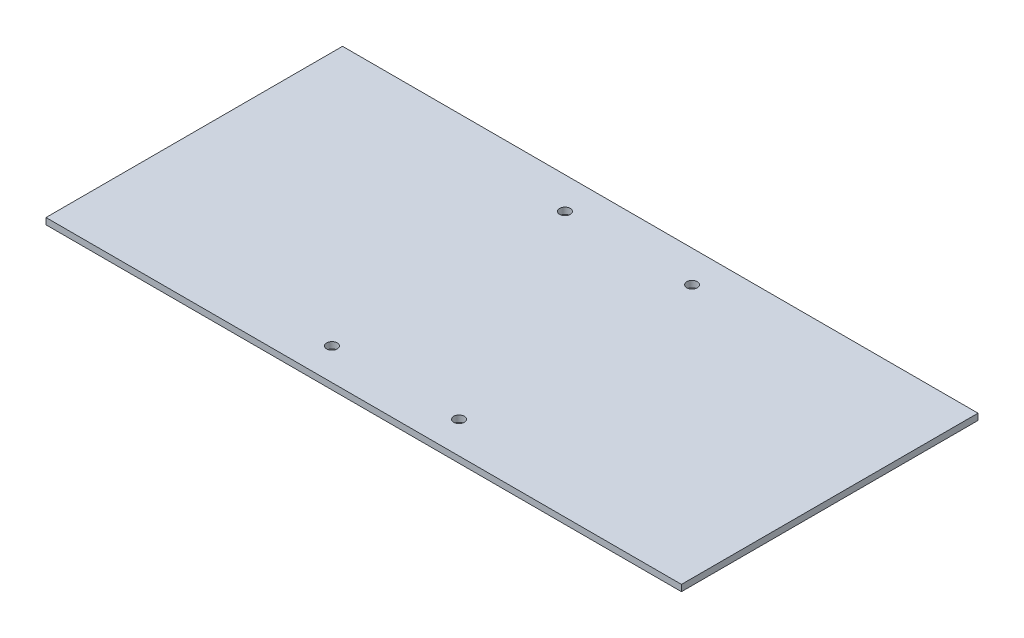
ISO-10303-21;
HEADER;
FILE_DESCRIPTION(('STEP AP214'),'2;1');
FILE_NAME('part.step','',(''),(''),'','','');
FILE_SCHEMA(('AUTOMOTIVE_DESIGN { 1 0 10303 214 1 1 1 1 }'));
ENDSEC;
DATA;
#1=APPLICATION_CONTEXT('core data for automotive mechanical design processes');
#2=APPLICATION_PROTOCOL_DEFINITION('international standard','automotive_design',2000,#1);
#3=PRODUCT_CONTEXT('',#1,'mechanical');
#4=PRODUCT('Part','Part','',(#3));
#5=PRODUCT_RELATED_PRODUCT_CATEGORY('part','',(#4));
#6=PRODUCT_DEFINITION_FORMATION('','',#4);
#7=PRODUCT_DEFINITION_CONTEXT('part definition',#1,'design');
#8=PRODUCT_DEFINITION('design','',#6,#7);
#9=PRODUCT_DEFINITION_SHAPE('','',#8);
#10=(LENGTH_UNIT() NAMED_UNIT(*) SI_UNIT(.MILLI.,.METRE.));
#11=(NAMED_UNIT(*) PLANE_ANGLE_UNIT() SI_UNIT($,.RADIAN.));
#12=(NAMED_UNIT(*) SI_UNIT($,.STERADIAN.) SOLID_ANGLE_UNIT());
#13=UNCERTAINTY_MEASURE_WITH_UNIT(LENGTH_MEASURE(1.E-05),#10,'distance_accuracy_value','');
#14=(GEOMETRIC_REPRESENTATION_CONTEXT(3) GLOBAL_UNCERTAINTY_ASSIGNED_CONTEXT((#13)) GLOBAL_UNIT_ASSIGNED_CONTEXT((#10,
#11,#12)) REPRESENTATION_CONTEXT('',''));
#15=CARTESIAN_POINT('',(0.,0.,0.));
#16=DIRECTION('',(0.,0.,1.));
#17=DIRECTION('',(1.,0.,0.));
#18=AXIS2_PLACEMENT_3D('',#15,#16,#17);
#19=CARTESIAN_POINT('',(-150.,3.,-70.));
#20=DIRECTION('',(1.,0.,0.));
#21=DIRECTION('',(0.,0.,-1.));
#22=AXIS2_PLACEMENT_3D('',#19,#20,#21);
#23=PLANE('',#22);
#24=DIRECTION('',(0.,0.,1.));
#25=VECTOR('',#24,1.);
#26=CARTESIAN_POINT('',(-150.,0.,-70.));
#27=LINE('',#26,#25);
#28=CARTESIAN_POINT('',(-150.,0.,-70.));
#29=VERTEX_POINT('',#28);
#30=CARTESIAN_POINT('',(-150.,0.,70.));
#31=VERTEX_POINT('',#30);
#32=EDGE_CURVE('E98',#29,#31,#27,.T.);
#33=ORIENTED_EDGE('',*,*,#32,.T.);
#34=DIRECTION('',(0.,-1.,0.));
#35=VECTOR('',#34,1.);
#36=CARTESIAN_POINT('',(-150.,3.,70.));
#37=LINE('',#36,#35);
#38=CARTESIAN_POINT('',(-150.,3.,70.));
#39=VERTEX_POINT('',#38);
#40=EDGE_CURVE('E11',#39,#31,#37,.T.);
#41=ORIENTED_EDGE('',*,*,#40,.F.);
#42=DIRECTION('',(0.,0.,1.));
#43=VECTOR('',#42,1.);
#44=CARTESIAN_POINT('',(-150.,3.,-70.));
#45=LINE('',#44,#43);
#46=CARTESIAN_POINT('',(-150.,3.,-70.));
#47=VERTEX_POINT('',#46);
#48=EDGE_CURVE('E86',#47,#39,#45,.T.);
#49=ORIENTED_EDGE('',*,*,#48,.F.);
#50=DIRECTION('',(0.,-1.,0.));
#51=VECTOR('',#50,1.);
#52=CARTESIAN_POINT('',(-150.,3.,-70.));
#53=LINE('',#52,#51);
#54=EDGE_CURVE('E94',#47,#29,#53,.T.);
#55=ORIENTED_EDGE('',*,*,#54,.T.);
#56=EDGE_LOOP('',(#33,#41,#49,#55));
#57=FACE_BOUND('',#56,.T.);
#58=ADVANCED_FACE('F35',(#57),#23,.F.);
#59=CARTESIAN_POINT('',(-150.,3.,70.));
#60=DIRECTION('',(0.,0.,-1.));
#61=DIRECTION('',(-1.,0.,0.));
#62=AXIS2_PLACEMENT_3D('',#59,#60,#61);
#63=PLANE('',#62);
#64=DIRECTION('',(1.,0.,0.));
#65=VECTOR('',#64,1.);
#66=CARTESIAN_POINT('',(-150.,0.,70.));
#67=LINE('',#66,#65);
#68=CARTESIAN_POINT('',(150.,0.,70.));
#69=VERTEX_POINT('',#68);
#70=EDGE_CURVE('E90',#31,#69,#67,.T.);
#71=ORIENTED_EDGE('',*,*,#70,.T.);
#72=DIRECTION('',(0.,-1.,0.));
#73=VECTOR('',#72,1.);
#74=CARTESIAN_POINT('',(150.,3.,70.));
#75=LINE('',#74,#73);
#76=CARTESIAN_POINT('',(150.,3.,70.));
#77=VERTEX_POINT('',#76);
#78=EDGE_CURVE('E43',#77,#69,#75,.T.);
#79=ORIENTED_EDGE('',*,*,#78,.F.);
#80=DIRECTION('',(1.,0.,0.));
#81=VECTOR('',#80,1.);
#82=CARTESIAN_POINT('',(-150.,3.,70.));
#83=LINE('',#82,#81);
#84=EDGE_CURVE('E81',#39,#77,#83,.T.);
#85=ORIENTED_EDGE('',*,*,#84,.F.);
#86=ORIENTED_EDGE('',*,*,#40,.T.);
#87=EDGE_LOOP('',(#71,#79,#85,#86));
#88=FACE_BOUND('',#87,.T.);
#89=ADVANCED_FACE('F89',(#88),#63,.F.);
#90=CARTESIAN_POINT('',(150.,3.,-70.));
#91=DIRECTION('',(-1.,0.,0.));
#92=DIRECTION('',(0.,0.,1.));
#93=AXIS2_PLACEMENT_3D('',#90,#91,#92);
#94=PLANE('',#93);
#95=DIRECTION('',(0.,0.,-1.));
#96=VECTOR('',#95,1.);
#97=CARTESIAN_POINT('',(150.,0.,-70.));
#98=LINE('',#97,#96);
#99=CARTESIAN_POINT('',(150.,0.,-70.));
#100=VERTEX_POINT('',#99);
#101=EDGE_CURVE('E68',#69,#100,#98,.T.);
#102=ORIENTED_EDGE('',*,*,#101,.T.);
#103=DIRECTION('',(0.,-1.,0.));
#104=VECTOR('',#103,1.);
#105=CARTESIAN_POINT('',(150.,3.,-70.));
#106=LINE('',#105,#104);
#107=CARTESIAN_POINT('',(150.,3.,-70.));
#108=VERTEX_POINT('',#107);
#109=EDGE_CURVE('E91',#108,#100,#106,.T.);
#110=ORIENTED_EDGE('',*,*,#109,.F.);
#111=DIRECTION('',(0.,0.,-1.));
#112=VECTOR('',#111,1.);
#113=CARTESIAN_POINT('',(150.,3.,-70.));
#114=LINE('',#113,#112);
#115=EDGE_CURVE('E84',#77,#108,#114,.T.);
#116=ORIENTED_EDGE('',*,*,#115,.F.);
#117=ORIENTED_EDGE('',*,*,#78,.T.);
#118=EDGE_LOOP('',(#102,#110,#116,#117));
#119=FACE_BOUND('',#118,.T.);
#120=ADVANCED_FACE('F92',(#119),#94,.F.);
#121=CARTESIAN_POINT('',(-150.,3.,-70.));
#122=DIRECTION('',(0.,0.,1.));
#123=DIRECTION('',(1.,0.,0.));
#124=AXIS2_PLACEMENT_3D('',#121,#122,#123);
#125=PLANE('',#124);
#126=DIRECTION('',(-1.,0.,0.));
#127=VECTOR('',#126,1.);
#128=CARTESIAN_POINT('',(-150.,0.,-70.));
#129=LINE('',#128,#127);
#130=EDGE_CURVE('E74',#100,#29,#129,.T.);
#131=ORIENTED_EDGE('',*,*,#130,.T.);
#132=ORIENTED_EDGE('',*,*,#54,.F.);
#133=DIRECTION('',(-1.,0.,0.));
#134=VECTOR('',#133,1.);
#135=CARTESIAN_POINT('',(-150.,3.,-70.));
#136=LINE('',#135,#134);
#137=EDGE_CURVE('E51',#108,#47,#136,.T.);
#138=ORIENTED_EDGE('',*,*,#137,.F.);
#139=ORIENTED_EDGE('',*,*,#109,.T.);
#140=EDGE_LOOP('',(#131,#132,#138,#139));
#141=FACE_BOUND('',#140,.T.);
#142=ADVANCED_FACE('F106',(#141),#125,.F.);
#143=CARTESIAN_POINT('',(0.,3.,0.));
#144=DIRECTION('',(0.,1.,0.));
#145=DIRECTION('',(0.,0.,1.));
#146=AXIS2_PLACEMENT_3D('',#143,#144,#145);
#147=PLANE('',#146);
#148=CARTESIAN_POINT('',(-30.,3.,55.));
#149=DIRECTION('',(0.,-1.,0.));
#150=DIRECTION('',(0.,0.,-1.));
#151=AXIS2_PLACEMENT_3D('',#148,#149,#150);
#152=CIRCLE('',#151,2.5);
#153=CARTESIAN_POINT('',(-30.,3.,52.5));
#154=VERTEX_POINT('',#153);
#155=EDGE_CURVE('E130',#154,#154,#152,.T.);
#156=ORIENTED_EDGE('',*,*,#155,.T.);
#157=EDGE_LOOP('',(#156));
#158=FACE_BOUND('',#157,.T.);
#159=CARTESIAN_POINT('',(30.,3.,55.));
#160=DIRECTION('',(0.,-1.,0.));
#161=DIRECTION('',(0.,0.,-1.));
#162=AXIS2_PLACEMENT_3D('',#159,#160,#161);
#163=CIRCLE('',#162,2.5);
#164=CARTESIAN_POINT('',(30.,3.,52.5));
#165=VERTEX_POINT('',#164);
#166=EDGE_CURVE('E124',#165,#165,#163,.T.);
#167=ORIENTED_EDGE('',*,*,#166,.T.);
#168=EDGE_LOOP('',(#167));
#169=FACE_BOUND('',#168,.T.);
#170=CARTESIAN_POINT('',(-30.,3.,-55.));
#171=DIRECTION('',(0.,1.,0.));
#172=DIRECTION('',(0.,0.,1.));
#173=AXIS2_PLACEMENT_3D('',#170,#171,#172);
#174=CIRCLE('',#173,2.5);
#175=CARTESIAN_POINT('',(-30.,3.,-52.5));
#176=VERTEX_POINT('',#175);
#177=EDGE_CURVE('E119',#176,#176,#174,.T.);
#178=ORIENTED_EDGE('',*,*,#177,.F.);
#179=EDGE_LOOP('',(#178));
#180=FACE_BOUND('',#179,.T.);
#181=CARTESIAN_POINT('',(30.,3.,-55.));
#182=DIRECTION('',(0.,1.,0.));
#183=DIRECTION('',(0.,0.,1.));
#184=AXIS2_PLACEMENT_3D('',#181,#182,#183);
#185=CIRCLE('',#184,2.5);
#186=CARTESIAN_POINT('',(30.,3.,-52.5));
#187=VERTEX_POINT('',#186);
#188=EDGE_CURVE('E112',#187,#187,#185,.T.);
#189=ORIENTED_EDGE('',*,*,#188,.F.);
#190=EDGE_LOOP('',(#189));
#191=FACE_BOUND('',#190,.T.);
#192=ORIENTED_EDGE('',*,*,#48,.T.);
#193=ORIENTED_EDGE('',*,*,#84,.T.);
#194=ORIENTED_EDGE('',*,*,#115,.T.);
#195=ORIENTED_EDGE('',*,*,#137,.T.);
#196=EDGE_LOOP('',(#192,#193,#194,#195));
#197=FACE_BOUND('',#196,.T.);
#198=ADVANCED_FACE('F82',(#158,#169,#180,#191,#197),#147,.T.);
#199=CARTESIAN_POINT('',(0.,0.,0.));
#200=DIRECTION('',(0.,1.,0.));
#201=DIRECTION('',(0.,0.,1.));
#202=AXIS2_PLACEMENT_3D('',#199,#200,#201);
#203=PLANE('',#202);
#204=CARTESIAN_POINT('',(-30.,0.,55.));
#205=DIRECTION('',(0.,-1.,0.));
#206=DIRECTION('',(0.,0.,-1.));
#207=AXIS2_PLACEMENT_3D('',#204,#205,#206);
#208=CIRCLE('',#207,2.5);
#209=CARTESIAN_POINT('',(-30.,0.,52.5));
#210=VERTEX_POINT('',#209);
#211=EDGE_CURVE('E116',#210,#210,#208,.T.);
#212=ORIENTED_EDGE('',*,*,#211,.F.);
#213=EDGE_LOOP('',(#212));
#214=FACE_BOUND('',#213,.T.);
#215=CARTESIAN_POINT('',(30.,0.,55.));
#216=DIRECTION('',(0.,-1.,0.));
#217=DIRECTION('',(0.,0.,-1.));
#218=AXIS2_PLACEMENT_3D('',#215,#216,#217);
#219=CIRCLE('',#218,2.5);
#220=CARTESIAN_POINT('',(30.,0.,52.5));
#221=VERTEX_POINT('',#220);
#222=EDGE_CURVE('E127',#221,#221,#219,.T.);
#223=ORIENTED_EDGE('',*,*,#222,.F.);
#224=EDGE_LOOP('',(#223));
#225=FACE_BOUND('',#224,.T.);
#226=CARTESIAN_POINT('',(-30.,0.,-55.));
#227=DIRECTION('',(0.,1.,0.));
#228=DIRECTION('',(0.,0.,1.));
#229=AXIS2_PLACEMENT_3D('',#226,#227,#228);
#230=CIRCLE('',#229,2.5);
#231=CARTESIAN_POINT('',(-30.,0.,-52.5));
#232=VERTEX_POINT('',#231);
#233=EDGE_CURVE('E101',#232,#232,#230,.T.);
#234=ORIENTED_EDGE('',*,*,#233,.T.);
#235=EDGE_LOOP('',(#234));
#236=FACE_BOUND('',#235,.T.);
#237=CARTESIAN_POINT('',(30.,0.,-55.));
#238=DIRECTION('',(0.,1.,0.));
#239=DIRECTION('',(0.,0.,1.));
#240=AXIS2_PLACEMENT_3D('',#237,#238,#239);
#241=CIRCLE('',#240,2.5);
#242=CARTESIAN_POINT('',(30.,0.,-52.5));
#243=VERTEX_POINT('',#242);
#244=EDGE_CURVE('E115',#243,#243,#241,.T.);
#245=ORIENTED_EDGE('',*,*,#244,.T.);
#246=EDGE_LOOP('',(#245));
#247=FACE_BOUND('',#246,.T.);
#248=ORIENTED_EDGE('',*,*,#32,.F.);
#249=ORIENTED_EDGE('',*,*,#130,.F.);
#250=ORIENTED_EDGE('',*,*,#101,.F.);
#251=ORIENTED_EDGE('',*,*,#70,.F.);
#252=EDGE_LOOP('',(#248,#249,#250,#251));
#253=FACE_BOUND('',#252,.T.);
#254=ADVANCED_FACE('F109',(#214,#225,#236,#247,#253),#203,.F.);
#255=CARTESIAN_POINT('',(30.,0.,-55.));
#256=DIRECTION('',(0.,1.,0.));
#257=DIRECTION('',(0.,0.,1.));
#258=AXIS2_PLACEMENT_3D('',#255,#256,#257);
#259=CYLINDRICAL_SURFACE('',#258,2.5);
#260=ORIENTED_EDGE('',*,*,#244,.F.);
#261=EDGE_LOOP('',(#260));
#262=FACE_BOUND('',#261,.T.);
#263=ORIENTED_EDGE('',*,*,#188,.T.);
#264=EDGE_LOOP('',(#263));
#265=FACE_BOUND('',#264,.T.);
#266=ADVANCED_FACE('F141',(#262,#265),#259,.F.);
#267=CARTESIAN_POINT('',(-30.,0.,-55.));
#268=DIRECTION('',(0.,1.,0.));
#269=DIRECTION('',(0.,0.,1.));
#270=AXIS2_PLACEMENT_3D('',#267,#268,#269);
#271=CYLINDRICAL_SURFACE('',#270,2.5);
#272=ORIENTED_EDGE('',*,*,#233,.F.);
#273=EDGE_LOOP('',(#272));
#274=FACE_BOUND('',#273,.T.);
#275=ORIENTED_EDGE('',*,*,#177,.T.);
#276=EDGE_LOOP('',(#275));
#277=FACE_BOUND('',#276,.T.);
#278=ADVANCED_FACE('F151',(#274,#277),#271,.F.);
#279=CARTESIAN_POINT('',(30.,0.,55.));
#280=DIRECTION('',(0.,1.,0.));
#281=DIRECTION('',(0.,0.,1.));
#282=AXIS2_PLACEMENT_3D('',#279,#280,#281);
#283=CYLINDRICAL_SURFACE('',#282,2.5);
#284=ORIENTED_EDGE('',*,*,#222,.T.);
#285=EDGE_LOOP('',(#284));
#286=FACE_BOUND('',#285,.T.);
#287=ORIENTED_EDGE('',*,*,#166,.F.);
#288=EDGE_LOOP('',(#287));
#289=FACE_BOUND('',#288,.T.);
#290=ADVANCED_FACE('F193',(#286,#289),#283,.F.);
#291=CARTESIAN_POINT('',(-30.,0.,55.));
#292=DIRECTION('',(0.,1.,0.));
#293=DIRECTION('',(0.,0.,1.));
#294=AXIS2_PLACEMENT_3D('',#291,#292,#293);
#295=CYLINDRICAL_SURFACE('',#294,2.5);
#296=ORIENTED_EDGE('',*,*,#211,.T.);
#297=EDGE_LOOP('',(#296));
#298=FACE_BOUND('',#297,.T.);
#299=ORIENTED_EDGE('',*,*,#155,.F.);
#300=EDGE_LOOP('',(#299));
#301=FACE_BOUND('',#300,.T.);
#302=ADVANCED_FACE('F136',(#298,#301),#295,.F.);
#303=CLOSED_SHELL('',(#58,#89,#120,#142,#198,#254,#266,#278,#290,#302));
#304=MANIFOLD_SOLID_BREP('B2',#303);
#305=ADVANCED_BREP_SHAPE_REPRESENTATION('',(#18,#304),#14);
#306=SHAPE_DEFINITION_REPRESENTATION(#9,#305);
ENDSEC;
END-ISO-10303-21;
